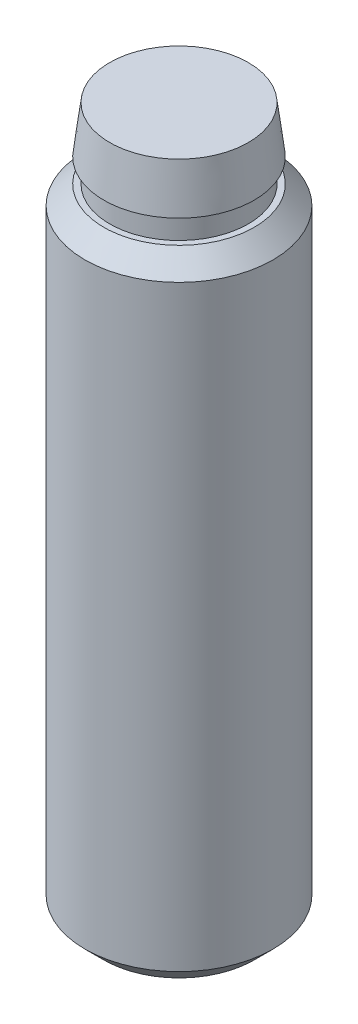
ISO-10303-21;
HEADER;
FILE_DESCRIPTION(('STEP AP214'),'2;1');
FILE_NAME('part.step','',(''),(''),'','','');
FILE_SCHEMA(('AUTOMOTIVE_DESIGN { 1 0 10303 214 1 1 1 1 }'));
ENDSEC;
DATA;
#1=APPLICATION_CONTEXT('core data for automotive mechanical design processes');
#2=APPLICATION_PROTOCOL_DEFINITION('international standard','automotive_design',2000,#1);
#3=PRODUCT_CONTEXT('',#1,'mechanical');
#4=PRODUCT('Part','Part','',(#3));
#5=PRODUCT_RELATED_PRODUCT_CATEGORY('part','',(#4));
#6=PRODUCT_DEFINITION_FORMATION('','',#4);
#7=PRODUCT_DEFINITION_CONTEXT('part definition',#1,'design');
#8=PRODUCT_DEFINITION('design','',#6,#7);
#9=PRODUCT_DEFINITION_SHAPE('','',#8);
#10=(LENGTH_UNIT() NAMED_UNIT(*) SI_UNIT(.MILLI.,.METRE.));
#11=(NAMED_UNIT(*) PLANE_ANGLE_UNIT() SI_UNIT($,.RADIAN.));
#12=(NAMED_UNIT(*) SI_UNIT($,.STERADIAN.) SOLID_ANGLE_UNIT());
#13=UNCERTAINTY_MEASURE_WITH_UNIT(LENGTH_MEASURE(1.E-05),#10,'distance_accuracy_value','');
#14=(GEOMETRIC_REPRESENTATION_CONTEXT(3) GLOBAL_UNCERTAINTY_ASSIGNED_CONTEXT((#13)) GLOBAL_UNIT_ASSIGNED_CONTEXT((#10,
#11,#12)) REPRESENTATION_CONTEXT('',''));
#15=CARTESIAN_POINT('',(0.,0.,0.));
#16=DIRECTION('',(0.,0.,1.));
#17=DIRECTION('',(1.,0.,0.));
#18=AXIS2_PLACEMENT_3D('',#15,#16,#17);
#19=CARTESIAN_POINT('',(0.,30.,0.));
#20=DIRECTION('',(0.,-1.,0.));
#21=DIRECTION('',(0.,0.,-1.));
#22=AXIS2_PLACEMENT_3D('',#19,#20,#21);
#23=PLANE('',#22);
#24=CARTESIAN_POINT('',(0.,30.,0.));
#25=DIRECTION('',(0.,-1.,0.));
#26=DIRECTION('',(0.,0.,-1.));
#27=AXIS2_PLACEMENT_3D('',#24,#25,#26);
#28=CIRCLE('',#27,2.94999999999999);
#29=CARTESIAN_POINT('',(0.,30.,-2.94999999999999));
#30=VERTEX_POINT('',#29);
#31=EDGE_CURVE('E41',#30,#30,#28,.T.);
#32=ORIENTED_EDGE('',*,*,#31,.F.);
#33=EDGE_LOOP('',(#32));
#34=FACE_BOUND('',#33,.T.);
#35=ADVANCED_FACE('F31',(#34),#23,.F.);
#36=CARTESIAN_POINT('',(0.,30.,0.));
#37=DIRECTION('',(0.,-1.,0.));
#38=DIRECTION('',(0.,0.,-1.));
#39=AXIS2_PLACEMENT_3D('',#36,#37,#38);
#40=CONICAL_SURFACE('',#39,2.94999999999999,0.124354994546761);
#41=CARTESIAN_POINT('',(0.,28.,0.));
#42=DIRECTION('',(0.,-1.,0.));
#43=DIRECTION('',(0.,0.,-1.));
#44=AXIS2_PLACEMENT_3D('',#41,#42,#43);
#45=CIRCLE('',#44,3.19999999999999);
#46=CARTESIAN_POINT('',(0.,28.,-3.19999999999999));
#47=VERTEX_POINT('',#46);
#48=EDGE_CURVE('E45',#47,#47,#45,.T.);
#49=ORIENTED_EDGE('',*,*,#48,.F.);
#50=EDGE_LOOP('',(#49));
#51=FACE_BOUND('',#50,.T.);
#52=ORIENTED_EDGE('',*,*,#31,.T.);
#53=EDGE_LOOP('',(#52));
#54=FACE_BOUND('',#53,.T.);
#55=ADVANCED_FACE('F85',(#51,#54),#40,.T.);
#56=CARTESIAN_POINT('',(2.94999999999999,28.,0.));
#57=DIRECTION('',(0.,-1.,0.));
#58=DIRECTION('',(0.,0.,-1.));
#59=AXIS2_PLACEMENT_3D('',#56,#57,#58);
#60=PLANE('',#59);
#61=ORIENTED_EDGE('',*,*,#48,.T.);
#62=EDGE_LOOP('',(#61));
#63=FACE_BOUND('',#62,.T.);
#64=CARTESIAN_POINT('',(0.,28.,0.));
#65=DIRECTION('',(0.,-1.,0.));
#66=DIRECTION('',(0.,0.,-1.));
#67=AXIS2_PLACEMENT_3D('',#64,#65,#66);
#68=CIRCLE('',#67,2.94999999999999);
#69=CARTESIAN_POINT('',(0.,28.,-2.94999999999999));
#70=VERTEX_POINT('',#69);
#71=EDGE_CURVE('E50',#70,#70,#68,.T.);
#72=ORIENTED_EDGE('',*,*,#71,.F.);
#73=EDGE_LOOP('',(#72));
#74=FACE_BOUND('',#73,.T.);
#75=ADVANCED_FACE('F80',(#63,#74),#60,.T.);
#76=CARTESIAN_POINT('',(0.,-1.36682242990654,0.));
#77=DIRECTION('',(0.,-1.,0.));
#78=DIRECTION('',(0.,0.,-1.));
#79=AXIS2_PLACEMENT_3D('',#76,#77,#78);
#80=CYLINDRICAL_SURFACE('',#79,2.94999999999999);
#81=CARTESIAN_POINT('',(0.,27.,0.));
#82=DIRECTION('',(0.,-1.,0.));
#83=DIRECTION('',(0.,0.,-1.));
#84=AXIS2_PLACEMENT_3D('',#81,#82,#83);
#85=CIRCLE('',#84,2.94999999999999);
#86=CARTESIAN_POINT('',(0.,27.,-2.94999999999999));
#87=VERTEX_POINT('',#86);
#88=EDGE_CURVE('E53',#87,#87,#85,.T.);
#89=ORIENTED_EDGE('',*,*,#88,.F.);
#90=EDGE_LOOP('',(#89));
#91=FACE_BOUND('',#90,.T.);
#92=ORIENTED_EDGE('',*,*,#71,.T.);
#93=EDGE_LOOP('',(#92));
#94=FACE_BOUND('',#93,.T.);
#95=ADVANCED_FACE('F74',(#91,#94),#80,.T.);
#96=CARTESIAN_POINT('',(2.94999999999999,27.,0.));
#97=DIRECTION('',(0.,-1.,0.));
#98=DIRECTION('',(0.,0.,-1.));
#99=AXIS2_PLACEMENT_3D('',#96,#97,#98);
#100=PLANE('',#99);
#101=CARTESIAN_POINT('',(0.,27.,0.));
#102=DIRECTION('',(0.,-1.,0.));
#103=DIRECTION('',(0.,0.,-1.));
#104=AXIS2_PLACEMENT_3D('',#101,#102,#103);
#105=CIRCLE('',#104,3.19999999999999);
#106=CARTESIAN_POINT('',(0.,27.,-3.19999999999999));
#107=VERTEX_POINT('',#106);
#108=EDGE_CURVE('E56',#107,#107,#105,.T.);
#109=ORIENTED_EDGE('',*,*,#108,.F.);
#110=EDGE_LOOP('',(#109));
#111=FACE_BOUND('',#110,.T.);
#112=ORIENTED_EDGE('',*,*,#88,.T.);
#113=EDGE_LOOP('',(#112));
#114=FACE_BOUND('',#113,.T.);
#115=ADVANCED_FACE('F68',(#111,#114),#100,.F.);
#116=CARTESIAN_POINT('',(0.,27.,0.));
#117=DIRECTION('',(0.,-1.,0.));
#118=DIRECTION('',(0.,0.,-1.));
#119=AXIS2_PLACEMENT_3D('',#116,#117,#118);
#120=CONICAL_SURFACE('',#119,3.19999999999999,0.785398163397448);
#121=CARTESIAN_POINT('',(0.,26.2,0.));
#122=DIRECTION('',(0.,-1.,0.));
#123=DIRECTION('',(0.,0.,-1.));
#124=AXIS2_PLACEMENT_3D('',#121,#122,#123);
#125=CIRCLE('',#124,3.99999999999999);
#126=CARTESIAN_POINT('',(0.,26.2,-3.99999999999999));
#127=VERTEX_POINT('',#126);
#128=EDGE_CURVE('E59',#127,#127,#125,.T.);
#129=ORIENTED_EDGE('',*,*,#128,.F.);
#130=EDGE_LOOP('',(#129));
#131=FACE_BOUND('',#130,.T.);
#132=ORIENTED_EDGE('',*,*,#108,.T.);
#133=EDGE_LOOP('',(#132));
#134=FACE_BOUND('',#133,.T.);
#135=ADVANCED_FACE('F65',(#131,#134),#120,.T.);
#136=CARTESIAN_POINT('',(0.,-1.36682242990654,0.));
#137=DIRECTION('',(0.,-1.,0.));
#138=DIRECTION('',(0.,0.,-1.));
#139=AXIS2_PLACEMENT_3D('',#136,#137,#138);
#140=CYLINDRICAL_SURFACE('',#139,3.99999999999999);
#141=CARTESIAN_POINT('',(0.,0.800000000000006,0.));
#142=DIRECTION('',(0.,-1.,0.));
#143=DIRECTION('',(0.,0.,-1.));
#144=AXIS2_PLACEMENT_3D('',#141,#142,#143);
#145=CIRCLE('',#144,3.99999999999999);
#146=CARTESIAN_POINT('',(0.,0.800000000000006,-3.99999999999999));
#147=VERTEX_POINT('',#146);
#148=EDGE_CURVE('E10',#147,#147,#145,.F.);
#149=ORIENTED_EDGE('',*,*,#148,.T.);
#150=EDGE_LOOP('',(#149));
#151=FACE_BOUND('',#150,.T.);
#152=ORIENTED_EDGE('',*,*,#128,.T.);
#153=EDGE_LOOP('',(#152));
#154=FACE_BOUND('',#153,.T.);
#155=ADVANCED_FACE('F63',(#151,#154),#140,.T.);
#156=CARTESIAN_POINT('',(0.,0.,0.));
#157=DIRECTION('',(0.,-1.,0.));
#158=DIRECTION('',(0.,0.,-1.));
#159=AXIS2_PLACEMENT_3D('',#156,#157,#158);
#160=PLANE('',#159);
#161=CARTESIAN_POINT('',(0.,0.,0.));
#162=DIRECTION('',(0.,-1.,0.));
#163=DIRECTION('',(0.,0.,-1.));
#164=AXIS2_PLACEMENT_3D('',#161,#162,#163);
#165=CIRCLE('',#164,3.19999999999998);
#166=CARTESIAN_POINT('',(0.,0.,-3.19999999999998));
#167=VERTEX_POINT('',#166);
#168=EDGE_CURVE('E37',#167,#167,#165,.T.);
#169=ORIENTED_EDGE('',*,*,#168,.T.);
#170=EDGE_LOOP('',(#169));
#171=FACE_BOUND('',#170,.T.);
#172=ADVANCED_FACE('F134',(#171),#160,.T.);
#173=CARTESIAN_POINT('',(0.,0.,0.));
#174=DIRECTION('',(0.,1.,0.));
#175=DIRECTION('',(0.,0.,1.));
#176=AXIS2_PLACEMENT_3D('',#173,#174,#175);
#177=CONICAL_SURFACE('',#176,3.19999999999998,0.785398163397454);
#178=ORIENTED_EDGE('',*,*,#148,.F.);
#179=EDGE_LOOP('',(#178));
#180=FACE_BOUND('',#179,.T.);
#181=ORIENTED_EDGE('',*,*,#168,.F.);
#182=EDGE_LOOP('',(#181));
#183=FACE_BOUND('',#182,.T.);
#184=ADVANCED_FACE('F142',(#180,#183),#177,.T.);
#185=CLOSED_SHELL('',(#35,#55,#75,#95,#115,#135,#155,#172,#184));
#186=MANIFOLD_SOLID_BREP('B2',#185);
#187=ADVANCED_BREP_SHAPE_REPRESENTATION('',(#18,#186),#14);
#188=SHAPE_DEFINITION_REPRESENTATION(#9,#187);
ENDSEC;
END-ISO-10303-21;
